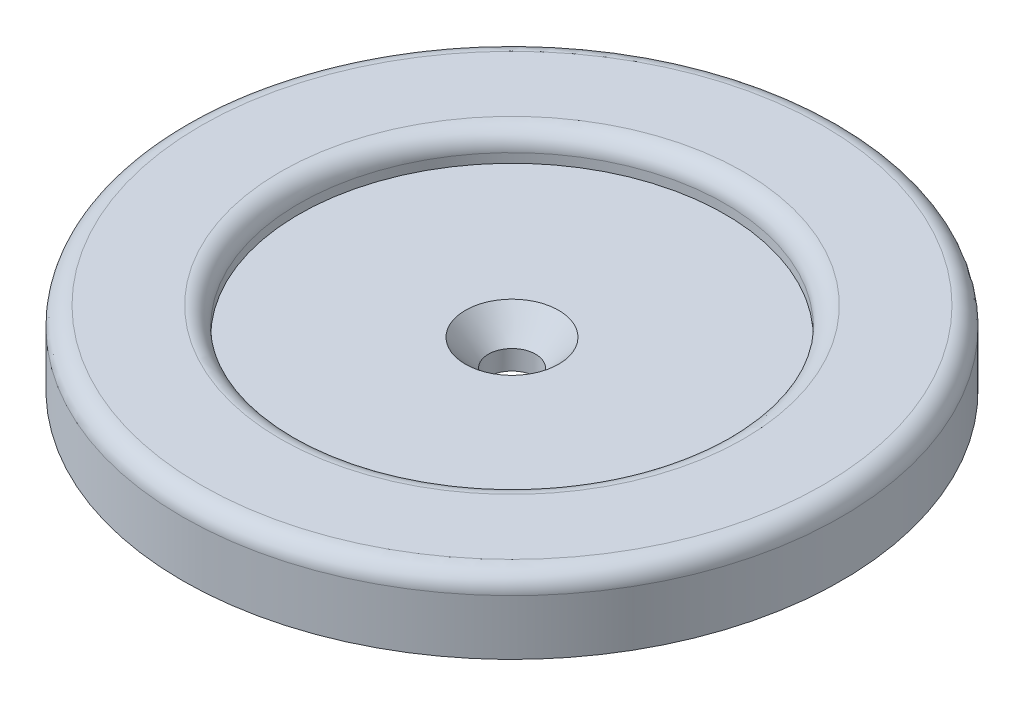
ISO-10303-21;
HEADER;
FILE_DESCRIPTION(('STEP AP214'),'2;1');
FILE_NAME('part.step','',(''),(''),'','','');
FILE_SCHEMA(('AUTOMOTIVE_DESIGN { 1 0 10303 214 1 1 1 1 }'));
ENDSEC;
DATA;
#1=APPLICATION_CONTEXT('core data for automotive mechanical design processes');
#2=APPLICATION_PROTOCOL_DEFINITION('international standard','automotive_design',2000,#1);
#3=PRODUCT_CONTEXT('',#1,'mechanical');
#4=PRODUCT('Part','Part','',(#3));
#5=PRODUCT_RELATED_PRODUCT_CATEGORY('part','',(#4));
#6=PRODUCT_DEFINITION_FORMATION('','',#4);
#7=PRODUCT_DEFINITION_CONTEXT('part definition',#1,'design');
#8=PRODUCT_DEFINITION('design','',#6,#7);
#9=PRODUCT_DEFINITION_SHAPE('','',#8);
#10=(LENGTH_UNIT() NAMED_UNIT(*) SI_UNIT(.MILLI.,.METRE.));
#11=(NAMED_UNIT(*) PLANE_ANGLE_UNIT() SI_UNIT($,.RADIAN.));
#12=(NAMED_UNIT(*) SI_UNIT($,.STERADIAN.) SOLID_ANGLE_UNIT());
#13=UNCERTAINTY_MEASURE_WITH_UNIT(LENGTH_MEASURE(1.E-05),#10,'distance_accuracy_value','');
#14=(GEOMETRIC_REPRESENTATION_CONTEXT(3) GLOBAL_UNCERTAINTY_ASSIGNED_CONTEXT((#13)) GLOBAL_UNIT_ASSIGNED_CONTEXT((#10,
#11,#12)) REPRESENTATION_CONTEXT('',''));
#15=CARTESIAN_POINT('',(0.,0.,0.));
#16=DIRECTION('',(0.,0.,1.));
#17=DIRECTION('',(1.,0.,0.));
#18=AXIS2_PLACEMENT_3D('',#15,#16,#17);
#19=CARTESIAN_POINT('',(0.,25.4,0.));
#20=DIRECTION('',(0.,1.,0.));
#21=DIRECTION('',(0.,0.,1.));
#22=AXIS2_PLACEMENT_3D('',#19,#20,#21);
#23=PLANE('',#22);
#24=CARTESIAN_POINT('',(0.,25.4,0.));
#25=DIRECTION('',(0.,1.,0.));
#26=DIRECTION('',(0.,0.,1.));
#27=AXIS2_PLACEMENT_3D('',#24,#25,#26);
#28=CIRCLE('',#27,6.4389);
#29=CARTESIAN_POINT('',(0.,25.4,6.4389));
#30=VERTEX_POINT('',#29);
#31=EDGE_CURVE('E75',#30,#30,#28,.T.);
#32=ORIENTED_EDGE('',*,*,#31,.F.);
#33=EDGE_LOOP('',(#32));
#34=FACE_BOUND('',#33,.T.);
#35=CARTESIAN_POINT('',(0.,25.4,0.));
#36=DIRECTION('',(0.,1.,0.));
#37=DIRECTION('',(0.,0.,1.));
#38=AXIS2_PLACEMENT_3D('',#35,#36,#37);
#39=CIRCLE('',#38,29.398178488335);
#40=CARTESIAN_POINT('',(0.,25.4,29.398178488335));
#41=VERTEX_POINT('',#40);
#42=EDGE_CURVE('E61',#41,#41,#39,.F.);
#43=ORIENTED_EDGE('',*,*,#42,.F.);
#44=EDGE_LOOP('',(#43));
#45=FACE_BOUND('',#44,.T.);
#46=ADVANCED_FACE('F37',(#34,#45),#23,.T.);
#47=CARTESIAN_POINT('',(0.,25.4,0.));
#48=DIRECTION('',(0.,-1.,0.));
#49=DIRECTION('',(0.,0.,-1.));
#50=AXIS2_PLACEMENT_3D('',#47,#48,#49);
#51=CYLINDRICAL_SURFACE('',#50,45.466);
#52=CARTESIAN_POINT('',(0.,26.67,0.));
#53=DIRECTION('',(0.,1.,0.));
#54=DIRECTION('',(0.,0.,1.));
#55=AXIS2_PLACEMENT_3D('',#52,#53,#54);
#56=CIRCLE('',#55,45.466);
#57=CARTESIAN_POINT('',(0.,26.67,45.466));
#58=VERTEX_POINT('',#57);
#59=EDGE_CURVE('E45',#58,#58,#56,.F.);
#60=ORIENTED_EDGE('',*,*,#59,.T.);
#61=EDGE_LOOP('',(#60));
#62=FACE_BOUND('',#61,.T.);
#63=CARTESIAN_POINT('',(0.,19.05,0.));
#64=DIRECTION('',(0.,-1.,0.));
#65=DIRECTION('',(0.,0.,-1.));
#66=AXIS2_PLACEMENT_3D('',#63,#64,#65);
#67=CIRCLE('',#66,45.466);
#68=CARTESIAN_POINT('',(0.,19.05,-45.466));
#69=VERTEX_POINT('',#68);
#70=EDGE_CURVE('E70',#69,#69,#67,.T.);
#71=ORIENTED_EDGE('',*,*,#70,.F.);
#72=EDGE_LOOP('',(#71));
#73=FACE_BOUND('',#72,.T.);
#74=ADVANCED_FACE('F308',(#62,#73),#51,.T.);
#75=CARTESIAN_POINT('',(0.,25.4,0.));
#76=DIRECTION('',(0.,1.,0.));
#77=DIRECTION('',(0.,0.,1.));
#78=AXIS2_PLACEMENT_3D('',#75,#76,#77);
#79=CYLINDRICAL_SURFACE('',#78,3.26389999999999);
#80=CARTESIAN_POINT('',(0.,21.7475803070733,0.));
#81=DIRECTION('',(0.,1.,0.));
#82=DIRECTION('',(0.,0.,1.));
#83=AXIS2_PLACEMENT_3D('',#80,#81,#82);
#84=CIRCLE('',#83,3.2639);
#85=CARTESIAN_POINT('',(0.,21.7475803070733,3.2639));
#86=VERTEX_POINT('',#85);
#87=EDGE_CURVE('E65',#86,#86,#84,.T.);
#88=ORIENTED_EDGE('',*,*,#87,.T.);
#89=EDGE_LOOP('',(#88));
#90=FACE_BOUND('',#89,.T.);
#91=CARTESIAN_POINT('',(0.,19.05,0.));
#92=DIRECTION('',(0.,-1.,0.));
#93=DIRECTION('',(0.,0.,-1.));
#94=AXIS2_PLACEMENT_3D('',#91,#92,#93);
#95=CIRCLE('',#94,3.26389999999999);
#96=CARTESIAN_POINT('',(0.,19.05,-3.26389999999999));
#97=VERTEX_POINT('',#96);
#98=EDGE_CURVE('E66',#97,#97,#95,.F.);
#99=ORIENTED_EDGE('',*,*,#98,.F.);
#100=EDGE_LOOP('',(#99));
#101=FACE_BOUND('',#100,.T.);
#102=ADVANCED_FACE('F310',(#90,#101),#79,.F.);
#103=CARTESIAN_POINT('',(0.,25.4,0.));
#104=DIRECTION('',(0.,1.,0.));
#105=DIRECTION('',(0.,0.,1.));
#106=AXIS2_PLACEMENT_3D('',#103,#104,#105);
#107=CONICAL_SURFACE('',#106,6.4389,0.715584993317675);
#108=ORIENTED_EDGE('',*,*,#87,.F.);
#109=EDGE_LOOP('',(#108));
#110=FACE_BOUND('',#109,.T.);
#111=ORIENTED_EDGE('',*,*,#31,.T.);
#112=EDGE_LOOP('',(#111));
#113=FACE_BOUND('',#112,.T.);
#114=ADVANCED_FACE('F287',(#110,#113),#107,.F.);
#115=CARTESIAN_POINT('',(0.,19.05,0.));
#116=DIRECTION('',(0.,-1.,0.));
#117=DIRECTION('',(0.,0.,-1.));
#118=AXIS2_PLACEMENT_3D('',#115,#116,#117);
#119=PLANE('',#118);
#120=CARTESIAN_POINT('',(-33.177315830712,19.05,-19.1549322258546));
#121=DIRECTION('',(0.,-1.,0.));
#122=DIRECTION('',(0.,0.,-1.));
#123=AXIS2_PLACEMENT_3D('',#120,#121,#122);
#124=CIRCLE('',#123,3.13086445170937);
#125=CARTESIAN_POINT('',(-33.177315830712,19.05,-22.2857966775639));
#126=VERTEX_POINT('',#125);
#127=EDGE_CURVE('E154',#126,#126,#124,.T.);
#128=ORIENTED_EDGE('',*,*,#127,.F.);
#129=EDGE_LOOP('',(#128));
#130=FACE_BOUND('',#129,.T.);
#131=CARTESIAN_POINT('',(-27.0891649401346,19.05,-27.0891649401399));
#132=DIRECTION('',(0.,-1.,0.));
#133=DIRECTION('',(0.,0.,-1.));
#134=AXIS2_PLACEMENT_3D('',#131,#132,#133);
#135=CIRCLE('',#134,3.13086445170968);
#136=CARTESIAN_POINT('',(-27.0891649401346,19.05,-30.2200293918495));
#137=VERTEX_POINT('',#136);
#138=EDGE_CURVE('E163',#137,#137,#135,.T.);
#139=ORIENTED_EDGE('',*,*,#138,.F.);
#140=EDGE_LOOP('',(#139));
#141=FACE_BOUND('',#140,.T.);
#142=CARTESIAN_POINT('',(-19.1549322258486,19.05,-33.1773158307163));
#143=DIRECTION('',(0.,-1.,0.));
#144=DIRECTION('',(0.,0.,-1.));
#145=AXIS2_PLACEMENT_3D('',#142,#143,#144);
#146=CIRCLE('',#145,3.13086445170985);
#147=CARTESIAN_POINT('',(-19.1549322258486,19.05,-36.3081802824262));
#148=VERTEX_POINT('',#147);
#149=EDGE_CURVE('E171',#148,#148,#146,.T.);
#150=ORIENTED_EDGE('',*,*,#149,.F.);
#151=EDGE_LOOP('',(#150));
#152=FACE_BOUND('',#151,.T.);
#153=CARTESIAN_POINT('',(-9.9153225353931,19.05,-37.0044874755363));
#154=DIRECTION('',(0.,-1.,0.));
#155=DIRECTION('',(0.,0.,-1.));
#156=AXIS2_PLACEMENT_3D('',#153,#154,#155);
#157=CIRCLE('',#156,3.13086445170988);
#158=CARTESIAN_POINT('',(-9.9153225353931,19.05,-40.1353519272461));
#159=VERTEX_POINT('',#158);
#160=EDGE_CURVE('E179',#159,#159,#157,.T.);
#161=ORIENTED_EDGE('',*,*,#160,.F.);
#162=EDGE_LOOP('',(#161));
#163=FACE_BOUND('',#162,.T.);
#164=CARTESIAN_POINT('',(4.34594413248282E-12,19.05,-38.3098644517054));
#165=DIRECTION('',(0.,-1.,0.));
#166=DIRECTION('',(0.,0.,-1.));
#167=AXIS2_PLACEMENT_3D('',#164,#165,#166);
#168=CIRCLE('',#167,3.13086445170976);
#169=CARTESIAN_POINT('',(4.34594413248282E-12,19.05,-41.4407289034151));
#170=VERTEX_POINT('',#169);
#171=EDGE_CURVE('E187',#170,#170,#168,.T.);
#172=ORIENTED_EDGE('',*,*,#171,.F.);
#173=EDGE_LOOP('',(#172));
#174=FACE_BOUND('',#173,.T.);
#175=CARTESIAN_POINT('',(9.91532253540166,19.05,-37.0044874755351));
#176=DIRECTION('',(0.,-1.,0.));
#177=DIRECTION('',(0.,0.,-1.));
#178=AXIS2_PLACEMENT_3D('',#175,#176,#177);
#179=CIRCLE('',#178,3.13086445170949);
#180=CARTESIAN_POINT('',(9.91532253540166,19.05,-40.1353519272446));
#181=VERTEX_POINT('',#180);
#182=EDGE_CURVE('E195',#181,#181,#179,.T.);
#183=ORIENTED_EDGE('',*,*,#182,.F.);
#184=EDGE_LOOP('',(#183));
#185=FACE_BOUND('',#184,.T.);
#186=CARTESIAN_POINT('',(19.1549322258567,19.05,-33.1773158307142));
#187=DIRECTION('',(0.,-1.,0.));
#188=DIRECTION('',(0.,0.,-1.));
#189=AXIS2_PLACEMENT_3D('',#186,#187,#188);
#190=CIRCLE('',#189,3.13086445170913);
#191=CARTESIAN_POINT('',(19.1549322258567,19.05,-36.3081802824233));
#192=VERTEX_POINT('',#191);
#193=EDGE_CURVE('E203',#192,#192,#190,.T.);
#194=ORIENTED_EDGE('',*,*,#193,.F.);
#195=EDGE_LOOP('',(#194));
#196=FACE_BOUND('',#195,.T.);
#197=CARTESIAN_POINT('',(27.089164940142,19.05,-27.0891649401368));
#198=DIRECTION('',(0.,-1.,0.));
#199=DIRECTION('',(0.,0.,-1.));
#200=AXIS2_PLACEMENT_3D('',#197,#198,#199);
#201=CIRCLE('',#200,3.13086445170864);
#202=CARTESIAN_POINT('',(27.089164940142,19.05,-30.2200293918454));
#203=VERTEX_POINT('',#202);
#204=EDGE_CURVE('E211',#203,#203,#201,.T.);
#205=ORIENTED_EDGE('',*,*,#204,.F.);
#206=EDGE_LOOP('',(#205));
#207=FACE_BOUND('',#206,.T.);
#208=CARTESIAN_POINT('',(33.1773158307185,19.05,-19.1549322258508));
#209=DIRECTION('',(0.,-1.,0.));
#210=DIRECTION('',(0.,0.,-1.));
#211=AXIS2_PLACEMENT_3D('',#208,#209,#210);
#212=CIRCLE('',#211,3.13086445170809);
#213=CARTESIAN_POINT('',(33.1773158307185,19.05,-22.2857966775589));
#214=VERTEX_POINT('',#213);
#215=EDGE_CURVE('E90',#214,#214,#212,.T.);
#216=ORIENTED_EDGE('',*,*,#215,.F.);
#217=EDGE_LOOP('',(#216));
#218=FACE_BOUND('',#217,.T.);
#219=CARTESIAN_POINT('',(37.0044874755384,19.05,-9.91532253539528));
#220=DIRECTION('',(0.,-1.,0.));
#221=DIRECTION('',(0.,0.,-1.));
#222=AXIS2_PLACEMENT_3D('',#219,#220,#221);
#223=CIRCLE('',#222,3.13086445170751);
#224=CARTESIAN_POINT('',(37.0044874755384,19.05,-13.0461869871028));
#225=VERTEX_POINT('',#224);
#226=EDGE_CURVE('E99',#225,#225,#223,.T.);
#227=ORIENTED_EDGE('',*,*,#226,.F.);
#228=EDGE_LOOP('',(#227));
#229=FACE_BOUND('',#228,.T.);
#230=CARTESIAN_POINT('',(38.3098644517075,19.05,2.17297206624141E-12));
#231=DIRECTION('',(0.,-1.,0.));
#232=DIRECTION('',(0.,0.,-1.));
#233=AXIS2_PLACEMENT_3D('',#230,#231,#232);
#234=CIRCLE('',#233,3.13086445170692);
#235=CARTESIAN_POINT('',(38.3098644517075,19.05,-3.13086445170475));
#236=VERTEX_POINT('',#235);
#237=EDGE_CURVE('E107',#236,#236,#234,.T.);
#238=ORIENTED_EDGE('',*,*,#237,.F.);
#239=EDGE_LOOP('',(#238));
#240=FACE_BOUND('',#239,.T.);
#241=CARTESIAN_POINT('',(37.0044874755373,19.05,9.91532253539949));
#242=DIRECTION('',(0.,-1.,0.));
#243=DIRECTION('',(0.,0.,-1.));
#244=AXIS2_PLACEMENT_3D('',#241,#242,#243);
#245=CIRCLE('',#244,3.13086445170639);
#246=CARTESIAN_POINT('',(37.0044874755373,19.05,6.7844580836931));
#247=VERTEX_POINT('',#246);
#248=EDGE_CURVE('E115',#247,#247,#245,.T.);
#249=ORIENTED_EDGE('',*,*,#248,.F.);
#250=EDGE_LOOP('',(#249));
#251=FACE_BOUND('',#250,.T.);
#252=CARTESIAN_POINT('',(33.1773158307163,19.05,19.1549322258546));
#253=DIRECTION('',(0.,-1.,0.));
#254=DIRECTION('',(0.,0.,-1.));
#255=AXIS2_PLACEMENT_3D('',#252,#253,#254);
#256=CIRCLE('',#255,3.13086445170593);
#257=CARTESIAN_POINT('',(33.1773158307163,19.05,16.0240677741486));
#258=VERTEX_POINT('',#257);
#259=EDGE_CURVE('E123',#258,#258,#256,.T.);
#260=ORIENTED_EDGE('',*,*,#259,.F.);
#261=EDGE_LOOP('',(#260));
#262=FACE_BOUND('',#261,.T.);
#263=CARTESIAN_POINT('',(27.0891649401389,19.05,27.0891649401398));
#264=DIRECTION('',(0.,-1.,0.));
#265=DIRECTION('',(0.,0.,-1.));
#266=AXIS2_PLACEMENT_3D('',#263,#264,#265);
#267=CIRCLE('',#266,3.13086445170557);
#268=CARTESIAN_POINT('',(27.0891649401389,19.05,23.9583004884343));
#269=VERTEX_POINT('',#268);
#270=EDGE_CURVE('E131',#269,#269,#267,.T.);
#271=ORIENTED_EDGE('',*,*,#270,.F.);
#272=EDGE_LOOP('',(#271));
#273=FACE_BOUND('',#272,.T.);
#274=CARTESIAN_POINT('',(19.154932225853,19.05,33.1773158307163));
#275=DIRECTION('',(0.,-1.,0.));
#276=DIRECTION('',(0.,0.,-1.));
#277=AXIS2_PLACEMENT_3D('',#274,#275,#276);
#278=CIRCLE('',#277,3.13086445170535);
#279=CARTESIAN_POINT('',(19.154932225853,19.05,30.046451379011));
#280=VERTEX_POINT('',#279);
#281=EDGE_CURVE('E139',#280,#280,#278,.T.);
#282=ORIENTED_EDGE('',*,*,#281,.F.);
#283=EDGE_LOOP('',(#282));
#284=FACE_BOUND('',#283,.T.);
#285=CARTESIAN_POINT('',(9.91532253539741,19.05,37.0044874755357));
#286=DIRECTION('',(0.,-1.,0.));
#287=DIRECTION('',(0.,0.,-1.));
#288=AXIS2_PLACEMENT_3D('',#285,#286,#287);
#289=CIRCLE('',#288,3.13086445170535);
#290=CARTESIAN_POINT('',(9.91532253539741,19.05,33.8736230238303));
#291=VERTEX_POINT('',#290);
#292=EDGE_CURVE('E147',#291,#291,#289,.T.);
#293=ORIENTED_EDGE('',*,*,#292,.F.);
#294=EDGE_LOOP('',(#293));
#295=FACE_BOUND('',#294,.T.);
#296=CARTESIAN_POINT('',(-37.004487475533,19.05,-9.91532253539951));
#297=DIRECTION('',(0.,-1.,0.));
#298=DIRECTION('',(0.,0.,-1.));
#299=AXIS2_PLACEMENT_3D('',#296,#297,#298);
#300=CIRCLE('',#299,3.13086445170897);
#301=CARTESIAN_POINT('',(-37.004487475533,19.05,-13.0461869871085));
#302=VERTEX_POINT('',#301);
#303=EDGE_CURVE('E266',#302,#302,#300,.T.);
#304=ORIENTED_EDGE('',*,*,#303,.F.);
#305=EDGE_LOOP('',(#304));
#306=FACE_BOUND('',#305,.T.);
#307=CARTESIAN_POINT('',(-38.3098644517032,19.05,-2.17766367152907E-12));
#308=DIRECTION('',(0.,-1.,0.));
#309=DIRECTION('',(0.,0.,-1.));
#310=AXIS2_PLACEMENT_3D('',#307,#308,#309);
#311=CIRCLE('',#310,3.13086445170845);
#312=CARTESIAN_POINT('',(-38.3098644517032,19.05,-3.13086445171063));
#313=VERTEX_POINT('',#312);
#314=EDGE_CURVE('E258',#313,#313,#311,.T.);
#315=ORIENTED_EDGE('',*,*,#314,.F.);
#316=EDGE_LOOP('',(#315));
#317=FACE_BOUND('',#316,.T.);
#318=CARTESIAN_POINT('',(-37.0044874755341,19.05,9.91532253539527));
#319=DIRECTION('',(0.,-1.,0.));
#320=DIRECTION('',(0.,0.,-1.));
#321=AXIS2_PLACEMENT_3D('',#318,#319,#320);
#322=CIRCLE('',#321,3.13086445170793);
#323=CARTESIAN_POINT('',(-37.0044874755341,19.05,6.78445808368734));
#324=VERTEX_POINT('',#323);
#325=EDGE_CURVE('E250',#324,#324,#322,.T.);
#326=ORIENTED_EDGE('',*,*,#325,.F.);
#327=EDGE_LOOP('',(#326));
#328=FACE_BOUND('',#327,.T.);
#329=CARTESIAN_POINT('',(-33.1773158307142,19.05,19.1549322258508));
#330=DIRECTION('',(0.,-1.,0.));
#331=DIRECTION('',(0.,0.,-1.));
#332=AXIS2_PLACEMENT_3D('',#329,#330,#331);
#333=CIRCLE('',#332,3.13086445170739);
#334=CARTESIAN_POINT('',(-33.1773158307142,19.05,16.0240677741434));
#335=VERTEX_POINT('',#334);
#336=EDGE_CURVE('E242',#335,#335,#333,.T.);
#337=ORIENTED_EDGE('',*,*,#336,.F.);
#338=EDGE_LOOP('',(#337));
#339=FACE_BOUND('',#338,.T.);
#340=CARTESIAN_POINT('',(-27.0891649401377,19.05,27.0891649401368));
#341=DIRECTION('',(0.,-1.,0.));
#342=DIRECTION('',(0.,0.,-1.));
#343=AXIS2_PLACEMENT_3D('',#340,#341,#342);
#344=CIRCLE('',#343,3.13086445170686);
#345=CARTESIAN_POINT('',(-27.0891649401377,19.05,23.9583004884299));
#346=VERTEX_POINT('',#345);
#347=EDGE_CURVE('E234',#346,#346,#344,.T.);
#348=ORIENTED_EDGE('',*,*,#347,.F.);
#349=EDGE_LOOP('',(#348));
#350=FACE_BOUND('',#349,.T.);
#351=CARTESIAN_POINT('',(-19.1549322258524,19.05,33.1773158307142));
#352=DIRECTION('',(0.,-1.,0.));
#353=DIRECTION('',(0.,0.,-1.));
#354=AXIS2_PLACEMENT_3D('',#351,#352,#353);
#355=CIRCLE('',#354,3.13086445170644);
#356=CARTESIAN_POINT('',(-19.1549322258524,19.05,30.0464513790077));
#357=VERTEX_POINT('',#356);
#358=EDGE_CURVE('E226',#357,#357,#355,.T.);
#359=ORIENTED_EDGE('',*,*,#358,.F.);
#360=EDGE_LOOP('',(#359));
#361=FACE_BOUND('',#360,.T.);
#362=CARTESIAN_POINT('',(-9.91532253539689,19.05,37.0044874755358));
#363=DIRECTION('',(0.,-1.,0.));
#364=DIRECTION('',(0.,0.,-1.));
#365=AXIS2_PLACEMENT_3D('',#362,#363,#364);
#366=CIRCLE('',#365,3.13086445170535);
#367=CARTESIAN_POINT('',(-9.91532253539689,19.05,33.8736230238305));
#368=VERTEX_POINT('',#367);
#369=EDGE_CURVE('E218',#368,#368,#366,.T.);
#370=ORIENTED_EDGE('',*,*,#369,.F.);
#371=EDGE_LOOP('',(#370));
#372=FACE_BOUND('',#371,.T.);
#373=CARTESIAN_POINT('',(0.,19.05,38.3098644517054));
#374=DIRECTION('',(0.,-1.,0.));
#375=DIRECTION('',(0.,0.,-1.));
#376=AXIS2_PLACEMENT_3D('',#373,#374,#375);
#377=CIRCLE('',#376,3.13086445170535);
#378=CARTESIAN_POINT('',(0.,19.05,35.179));
#379=VERTEX_POINT('',#378);
#380=EDGE_CURVE('E82',#379,#379,#377,.T.);
#381=ORIENTED_EDGE('',*,*,#380,.F.);
#382=EDGE_LOOP('',(#381));
#383=FACE_BOUND('',#382,.T.);
#384=ORIENTED_EDGE('',*,*,#98,.T.);
#385=EDGE_LOOP('',(#384));
#386=FACE_BOUND('',#385,.T.);
#387=ORIENTED_EDGE('',*,*,#70,.T.);
#388=EDGE_LOOP('',(#387));
#389=FACE_BOUND('',#388,.T.);
#390=ADVANCED_FACE('F283',(#130,#141,#152,#163,#174,#185,#196,#207,#218,#229,#240,#251,#262,
#273,#284,#295,#306,#317,#328,#339,#350,#361,#372,#383,#386,#389),#119,.T.);
#391=CARTESIAN_POINT('',(0.,29.21,0.));
#392=DIRECTION('',(0.,1.,0.));
#393=DIRECTION('',(0.,0.,1.));
#394=AXIS2_PLACEMENT_3D('',#391,#392,#393);
#395=PLANE('',#394);
#396=CARTESIAN_POINT('',(0.,29.21,0.));
#397=DIRECTION('',(0.,1.,0.));
#398=DIRECTION('',(0.,0.,1.));
#399=AXIS2_PLACEMENT_3D('',#396,#397,#398);
#400=CIRCLE('',#399,42.926);
#401=CARTESIAN_POINT('',(0.,29.21,42.926));
#402=VERTEX_POINT('',#401);
#403=EDGE_CURVE('E50',#402,#402,#400,.T.);
#404=ORIENTED_EDGE('',*,*,#403,.T.);
#405=EDGE_LOOP('',(#404));
#406=FACE_BOUND('',#405,.T.);
#407=CARTESIAN_POINT('',(0.,29.21,0.));
#408=DIRECTION('',(0.,1.,0.));
#409=DIRECTION('',(0.,0.,1.));
#410=AXIS2_PLACEMENT_3D('',#407,#408,#409);
#411=CIRCLE('',#410,31.938178488335);
#412=CARTESIAN_POINT('',(0.,29.21,31.938178488335));
#413=VERTEX_POINT('',#412);
#414=EDGE_CURVE('E55',#413,#413,#411,.F.);
#415=ORIENTED_EDGE('',*,*,#414,.T.);
#416=EDGE_LOOP('',(#415));
#417=FACE_BOUND('',#416,.T.);
#418=ADVANCED_FACE('F286',(#406,#417),#395,.T.);
#419=CARTESIAN_POINT('',(0.,29.21,0.));
#420=DIRECTION('',(0.,-1.,0.));
#421=DIRECTION('',(0.,0.,-1.));
#422=AXIS2_PLACEMENT_3D('',#419,#420,#421);
#423=CYLINDRICAL_SURFACE('',#422,29.398178488335);
#424=CARTESIAN_POINT('',(0.,26.67,0.));
#425=DIRECTION('',(0.,1.,0.));
#426=DIRECTION('',(0.,0.,1.));
#427=AXIS2_PLACEMENT_3D('',#424,#425,#426);
#428=CIRCLE('',#427,29.398178488335);
#429=CARTESIAN_POINT('',(0.,26.67,29.398178488335));
#430=VERTEX_POINT('',#429);
#431=EDGE_CURVE('E10',#430,#430,#428,.T.);
#432=ORIENTED_EDGE('',*,*,#431,.T.);
#433=EDGE_LOOP('',(#432));
#434=FACE_BOUND('',#433,.T.);
#435=ORIENTED_EDGE('',*,*,#42,.T.);
#436=EDGE_LOOP('',(#435));
#437=FACE_BOUND('',#436,.T.);
#438=ADVANCED_FACE('F338',(#434,#437),#423,.F.);
#439=CARTESIAN_POINT('',(0.,25.4,38.3098644517054));
#440=DIRECTION('',(0.,-1.,0.));
#441=DIRECTION('',(0.,0.,-1.));
#442=AXIS2_PLACEMENT_3D('',#439,#440,#441);
#443=CYLINDRICAL_SURFACE('',#442,3.13086445170535);
#444=CARTESIAN_POINT('',(0.,25.4,38.3098644517054));
#445=DIRECTION('',(0.,-1.,0.));
#446=DIRECTION('',(0.,0.,-1.));
#447=AXIS2_PLACEMENT_3D('',#444,#445,#446);
#448=CIRCLE('',#447,3.13086445170535);
#449=CARTESIAN_POINT('',(0.,25.4,35.179));
#450=VERTEX_POINT('',#449);
#451=EDGE_CURVE('E71',#450,#450,#448,.T.);
#452=ORIENTED_EDGE('',*,*,#451,.F.);
#453=EDGE_LOOP('',(#452));
#454=FACE_BOUND('',#453,.T.);
#455=ORIENTED_EDGE('',*,*,#380,.T.);
#456=EDGE_LOOP('',(#455));
#457=FACE_BOUND('',#456,.T.);
#458=ADVANCED_FACE('F345',(#454,#457),#443,.F.);
#459=CARTESIAN_POINT('',(0.,25.4,38.3098644517054));
#460=DIRECTION('',(0.,-1.,0.));
#461=DIRECTION('',(0.,0.,-1.));
#462=AXIS2_PLACEMENT_3D('',#459,#460,#461);
#463=PLANE('',#462);
#464=ORIENTED_EDGE('',*,*,#451,.T.);
#465=EDGE_LOOP('',(#464));
#466=FACE_BOUND('',#465,.T.);
#467=ADVANCED_FACE('F399',(#466),#463,.T.);
#468=CARTESIAN_POINT('',(-9.91532253539689,25.4,37.0044874755358));
#469=DIRECTION('',(0.,-1.,0.));
#470=DIRECTION('',(0.,0.,-1.));
#471=AXIS2_PLACEMENT_3D('',#468,#469,#470);
#472=CYLINDRICAL_SURFACE('',#471,3.13086445170535);
#473=CARTESIAN_POINT('',(-9.91532253539689,25.4,37.0044874755358));
#474=DIRECTION('',(0.,-1.,0.));
#475=DIRECTION('',(0.,0.,-1.));
#476=AXIS2_PLACEMENT_3D('',#473,#474,#475);
#477=CIRCLE('',#476,3.13086445170535);
#478=CARTESIAN_POINT('',(-9.91532253539689,25.4,33.8736230238305));
#479=VERTEX_POINT('',#478);
#480=EDGE_CURVE('E222',#479,#479,#477,.T.);
#481=ORIENTED_EDGE('',*,*,#480,.F.);
#482=EDGE_LOOP('',(#481));
#483=FACE_BOUND('',#482,.T.);
#484=ORIENTED_EDGE('',*,*,#369,.T.);
#485=EDGE_LOOP('',(#484));
#486=FACE_BOUND('',#485,.T.);
#487=ADVANCED_FACE('F407',(#483,#486),#472,.F.);
#488=CARTESIAN_POINT('',(-9.91532253539689,25.4,37.0044874755358));
#489=DIRECTION('',(0.,-1.,0.));
#490=DIRECTION('',(0.,0.,-1.));
#491=AXIS2_PLACEMENT_3D('',#488,#489,#490);
#492=PLANE('',#491);
#493=ORIENTED_EDGE('',*,*,#480,.T.);
#494=EDGE_LOOP('',(#493));
#495=FACE_BOUND('',#494,.T.);
#496=ADVANCED_FACE('F416',(#495),#492,.T.);
#497=CARTESIAN_POINT('',(-19.1549322258524,25.4,33.1773158307142));
#498=DIRECTION('',(0.,-1.,0.));
#499=DIRECTION('',(0.,0.,-1.));
#500=AXIS2_PLACEMENT_3D('',#497,#498,#499);
#501=CYLINDRICAL_SURFACE('',#500,3.13086445170644);
#502=CARTESIAN_POINT('',(-19.1549322258524,25.4,33.1773158307142));
#503=DIRECTION('',(0.,-1.,0.));
#504=DIRECTION('',(0.,0.,-1.));
#505=AXIS2_PLACEMENT_3D('',#502,#503,#504);
#506=CIRCLE('',#505,3.13086445170644);
#507=CARTESIAN_POINT('',(-19.1549322258524,25.4,30.0464513790077));
#508=VERTEX_POINT('',#507);
#509=EDGE_CURVE('E230',#508,#508,#506,.T.);
#510=ORIENTED_EDGE('',*,*,#509,.F.);
#511=EDGE_LOOP('',(#510));
#512=FACE_BOUND('',#511,.T.);
#513=ORIENTED_EDGE('',*,*,#358,.T.);
#514=EDGE_LOOP('',(#513));
#515=FACE_BOUND('',#514,.T.);
#516=ADVANCED_FACE('F425',(#512,#515),#501,.F.);
#517=CARTESIAN_POINT('',(-19.1549322258524,25.4,33.1773158307142));
#518=DIRECTION('',(0.,-1.,0.));
#519=DIRECTION('',(0.,0.,-1.));
#520=AXIS2_PLACEMENT_3D('',#517,#518,#519);
#521=PLANE('',#520);
#522=ORIENTED_EDGE('',*,*,#509,.T.);
#523=EDGE_LOOP('',(#522));
#524=FACE_BOUND('',#523,.T.);
#525=ADVANCED_FACE('F434',(#524),#521,.T.);
#526=CARTESIAN_POINT('',(-27.0891649401377,25.4,27.0891649401368));
#527=DIRECTION('',(0.,-1.,0.));
#528=DIRECTION('',(0.,0.,-1.));
#529=AXIS2_PLACEMENT_3D('',#526,#527,#528);
#530=CYLINDRICAL_SURFACE('',#529,3.13086445170686);
#531=CARTESIAN_POINT('',(-27.0891649401377,25.4,27.0891649401368));
#532=DIRECTION('',(0.,-1.,0.));
#533=DIRECTION('',(0.,0.,-1.));
#534=AXIS2_PLACEMENT_3D('',#531,#532,#533);
#535=CIRCLE('',#534,3.13086445170686);
#536=CARTESIAN_POINT('',(-27.0891649401377,25.4,23.9583004884299));
#537=VERTEX_POINT('',#536);
#538=EDGE_CURVE('E238',#537,#537,#535,.T.);
#539=ORIENTED_EDGE('',*,*,#538,.F.);
#540=EDGE_LOOP('',(#539));
#541=FACE_BOUND('',#540,.T.);
#542=ORIENTED_EDGE('',*,*,#347,.T.);
#543=EDGE_LOOP('',(#542));
#544=FACE_BOUND('',#543,.T.);
#545=ADVANCED_FACE('F443',(#541,#544),#530,.F.);
#546=CARTESIAN_POINT('',(-27.0891649401377,25.4,27.0891649401368));
#547=DIRECTION('',(0.,-1.,0.));
#548=DIRECTION('',(0.,0.,-1.));
#549=AXIS2_PLACEMENT_3D('',#546,#547,#548);
#550=PLANE('',#549);
#551=ORIENTED_EDGE('',*,*,#538,.T.);
#552=EDGE_LOOP('',(#551));
#553=FACE_BOUND('',#552,.T.);
#554=ADVANCED_FACE('F452',(#553),#550,.T.);
#555=CARTESIAN_POINT('',(-33.1773158307142,25.4,19.1549322258508));
#556=DIRECTION('',(0.,-1.,0.));
#557=DIRECTION('',(0.,0.,-1.));
#558=AXIS2_PLACEMENT_3D('',#555,#556,#557);
#559=CYLINDRICAL_SURFACE('',#558,3.13086445170739);
#560=CARTESIAN_POINT('',(-33.1773158307142,25.4,19.1549322258508));
#561=DIRECTION('',(0.,-1.,0.));
#562=DIRECTION('',(0.,0.,-1.));
#563=AXIS2_PLACEMENT_3D('',#560,#561,#562);
#564=CIRCLE('',#563,3.13086445170739);
#565=CARTESIAN_POINT('',(-33.1773158307142,25.4,16.0240677741434));
#566=VERTEX_POINT('',#565);
#567=EDGE_CURVE('E246',#566,#566,#564,.T.);
#568=ORIENTED_EDGE('',*,*,#567,.F.);
#569=EDGE_LOOP('',(#568));
#570=FACE_BOUND('',#569,.T.);
#571=ORIENTED_EDGE('',*,*,#336,.T.);
#572=EDGE_LOOP('',(#571));
#573=FACE_BOUND('',#572,.T.);
#574=ADVANCED_FACE('F461',(#570,#573),#559,.F.);
#575=CARTESIAN_POINT('',(-33.1773158307142,25.4,19.1549322258508));
#576=DIRECTION('',(0.,-1.,0.));
#577=DIRECTION('',(0.,0.,-1.));
#578=AXIS2_PLACEMENT_3D('',#575,#576,#577);
#579=PLANE('',#578);
#580=ORIENTED_EDGE('',*,*,#567,.T.);
#581=EDGE_LOOP('',(#580));
#582=FACE_BOUND('',#581,.T.);
#583=ADVANCED_FACE('F470',(#582),#579,.T.);
#584=CARTESIAN_POINT('',(-37.0044874755341,25.4,9.91532253539527));
#585=DIRECTION('',(0.,-1.,0.));
#586=DIRECTION('',(0.,0.,-1.));
#587=AXIS2_PLACEMENT_3D('',#584,#585,#586);
#588=CYLINDRICAL_SURFACE('',#587,3.13086445170793);
#589=CARTESIAN_POINT('',(-37.0044874755341,25.4,9.91532253539527));
#590=DIRECTION('',(0.,-1.,0.));
#591=DIRECTION('',(0.,0.,-1.));
#592=AXIS2_PLACEMENT_3D('',#589,#590,#591);
#593=CIRCLE('',#592,3.13086445170793);
#594=CARTESIAN_POINT('',(-37.0044874755341,25.4,6.78445808368734));
#595=VERTEX_POINT('',#594);
#596=EDGE_CURVE('E254',#595,#595,#593,.T.);
#597=ORIENTED_EDGE('',*,*,#596,.F.);
#598=EDGE_LOOP('',(#597));
#599=FACE_BOUND('',#598,.T.);
#600=ORIENTED_EDGE('',*,*,#325,.T.);
#601=EDGE_LOOP('',(#600));
#602=FACE_BOUND('',#601,.T.);
#603=ADVANCED_FACE('F479',(#599,#602),#588,.F.);
#604=CARTESIAN_POINT('',(-37.0044874755341,25.4,9.91532253539527));
#605=DIRECTION('',(0.,-1.,0.));
#606=DIRECTION('',(0.,0.,-1.));
#607=AXIS2_PLACEMENT_3D('',#604,#605,#606);
#608=PLANE('',#607);
#609=ORIENTED_EDGE('',*,*,#596,.T.);
#610=EDGE_LOOP('',(#609));
#611=FACE_BOUND('',#610,.T.);
#612=ADVANCED_FACE('F488',(#611),#608,.T.);
#613=CARTESIAN_POINT('',(-38.3098644517032,25.4,-2.17766367152907E-12));
#614=DIRECTION('',(0.,-1.,0.));
#615=DIRECTION('',(0.,0.,-1.));
#616=AXIS2_PLACEMENT_3D('',#613,#614,#615);
#617=CYLINDRICAL_SURFACE('',#616,3.13086445170845);
#618=CARTESIAN_POINT('',(-38.3098644517032,25.4,-2.17766367152907E-12));
#619=DIRECTION('',(0.,-1.,0.));
#620=DIRECTION('',(0.,0.,-1.));
#621=AXIS2_PLACEMENT_3D('',#618,#619,#620);
#622=CIRCLE('',#621,3.13086445170845);
#623=CARTESIAN_POINT('',(-38.3098644517032,25.4,-3.13086445171063));
#624=VERTEX_POINT('',#623);
#625=EDGE_CURVE('E262',#624,#624,#622,.T.);
#626=ORIENTED_EDGE('',*,*,#625,.F.);
#627=EDGE_LOOP('',(#626));
#628=FACE_BOUND('',#627,.T.);
#629=ORIENTED_EDGE('',*,*,#314,.T.);
#630=EDGE_LOOP('',(#629));
#631=FACE_BOUND('',#630,.T.);
#632=ADVANCED_FACE('F497',(#628,#631),#617,.F.);
#633=CARTESIAN_POINT('',(-38.3098644517032,25.4,-2.17766367152907E-12));
#634=DIRECTION('',(0.,-1.,0.));
#635=DIRECTION('',(0.,0.,-1.));
#636=AXIS2_PLACEMENT_3D('',#633,#634,#635);
#637=PLANE('',#636);
#638=ORIENTED_EDGE('',*,*,#625,.T.);
#639=EDGE_LOOP('',(#638));
#640=FACE_BOUND('',#639,.T.);
#641=ADVANCED_FACE('F279',(#640),#637,.T.);
#642=CARTESIAN_POINT('',(-37.004487475533,25.4,-9.91532253539951));
#643=DIRECTION('',(0.,-1.,0.));
#644=DIRECTION('',(0.,0.,-1.));
#645=AXIS2_PLACEMENT_3D('',#642,#643,#644);
#646=CYLINDRICAL_SURFACE('',#645,3.13086445170897);
#647=CARTESIAN_POINT('',(-37.004487475533,25.4,-9.91532253539951));
#648=DIRECTION('',(0.,-1.,0.));
#649=DIRECTION('',(0.,0.,-1.));
#650=AXIS2_PLACEMENT_3D('',#647,#648,#649);
#651=CIRCLE('',#650,3.13086445170897);
#652=CARTESIAN_POINT('',(-37.004487475533,25.4,-13.0461869871085));
#653=VERTEX_POINT('',#652);
#654=EDGE_CURVE('E159',#653,#653,#651,.T.);
#655=ORIENTED_EDGE('',*,*,#654,.F.);
#656=EDGE_LOOP('',(#655));
#657=FACE_BOUND('',#656,.T.);
#658=ORIENTED_EDGE('',*,*,#303,.T.);
#659=EDGE_LOOP('',(#658));
#660=FACE_BOUND('',#659,.T.);
#661=ADVANCED_FACE('F276',(#657,#660),#646,.F.);
#662=CARTESIAN_POINT('',(-37.004487475533,25.4,-9.91532253539951));
#663=DIRECTION('',(0.,-1.,0.));
#664=DIRECTION('',(0.,0.,-1.));
#665=AXIS2_PLACEMENT_3D('',#662,#663,#664);
#666=PLANE('',#665);
#667=ORIENTED_EDGE('',*,*,#654,.T.);
#668=EDGE_LOOP('',(#667));
#669=FACE_BOUND('',#668,.T.);
#670=ADVANCED_FACE('F274',(#669),#666,.T.);
#671=CARTESIAN_POINT('',(9.91532253539741,25.4,37.0044874755357));
#672=DIRECTION('',(0.,-1.,0.));
#673=DIRECTION('',(0.,0.,-1.));
#674=AXIS2_PLACEMENT_3D('',#671,#672,#673);
#675=CYLINDRICAL_SURFACE('',#674,3.13086445170535);
#676=CARTESIAN_POINT('',(9.91532253539741,25.4,37.0044874755357));
#677=DIRECTION('',(0.,-1.,0.));
#678=DIRECTION('',(0.,0.,-1.));
#679=AXIS2_PLACEMENT_3D('',#676,#677,#678);
#680=CIRCLE('',#679,3.13086445170535);
#681=CARTESIAN_POINT('',(9.91532253539741,25.4,33.8736230238303));
#682=VERTEX_POINT('',#681);
#683=EDGE_CURVE('E86',#682,#682,#680,.T.);
#684=ORIENTED_EDGE('',*,*,#683,.F.);
#685=EDGE_LOOP('',(#684));
#686=FACE_BOUND('',#685,.T.);
#687=ORIENTED_EDGE('',*,*,#292,.T.);
#688=EDGE_LOOP('',(#687));
#689=FACE_BOUND('',#688,.T.);
#690=ADVANCED_FACE('F527',(#686,#689),#675,.F.);
#691=CARTESIAN_POINT('',(9.91532253539741,25.4,37.0044874755357));
#692=DIRECTION('',(0.,-1.,0.));
#693=DIRECTION('',(0.,0.,-1.));
#694=AXIS2_PLACEMENT_3D('',#691,#692,#693);
#695=PLANE('',#694);
#696=ORIENTED_EDGE('',*,*,#683,.T.);
#697=EDGE_LOOP('',(#696));
#698=FACE_BOUND('',#697,.T.);
#699=ADVANCED_FACE('F535',(#698),#695,.T.);
#700=CARTESIAN_POINT('',(19.154932225853,25.4,33.1773158307163));
#701=DIRECTION('',(0.,-1.,0.));
#702=DIRECTION('',(0.,0.,-1.));
#703=AXIS2_PLACEMENT_3D('',#700,#701,#702);
#704=CYLINDRICAL_SURFACE('',#703,3.13086445170535);
#705=CARTESIAN_POINT('',(19.154932225853,25.4,33.1773158307163));
#706=DIRECTION('',(0.,-1.,0.));
#707=DIRECTION('',(0.,0.,-1.));
#708=AXIS2_PLACEMENT_3D('',#705,#706,#707);
#709=CIRCLE('',#708,3.13086445170535);
#710=CARTESIAN_POINT('',(19.154932225853,25.4,30.046451379011));
#711=VERTEX_POINT('',#710);
#712=EDGE_CURVE('E143',#711,#711,#709,.T.);
#713=ORIENTED_EDGE('',*,*,#712,.F.);
#714=EDGE_LOOP('',(#713));
#715=FACE_BOUND('',#714,.T.);
#716=ORIENTED_EDGE('',*,*,#281,.T.);
#717=EDGE_LOOP('',(#716));
#718=FACE_BOUND('',#717,.T.);
#719=ADVANCED_FACE('F544',(#715,#718),#704,.F.);
#720=CARTESIAN_POINT('',(19.154932225853,25.4,33.1773158307163));
#721=DIRECTION('',(0.,-1.,0.));
#722=DIRECTION('',(0.,0.,-1.));
#723=AXIS2_PLACEMENT_3D('',#720,#721,#722);
#724=PLANE('',#723);
#725=ORIENTED_EDGE('',*,*,#712,.T.);
#726=EDGE_LOOP('',(#725));
#727=FACE_BOUND('',#726,.T.);
#728=ADVANCED_FACE('F553',(#727),#724,.T.);
#729=CARTESIAN_POINT('',(27.0891649401389,25.4,27.0891649401398));
#730=DIRECTION('',(0.,-1.,0.));
#731=DIRECTION('',(0.,0.,-1.));
#732=AXIS2_PLACEMENT_3D('',#729,#730,#731);
#733=CYLINDRICAL_SURFACE('',#732,3.13086445170557);
#734=CARTESIAN_POINT('',(27.0891649401389,25.4,27.0891649401398));
#735=DIRECTION('',(0.,-1.,0.));
#736=DIRECTION('',(0.,0.,-1.));
#737=AXIS2_PLACEMENT_3D('',#734,#735,#736);
#738=CIRCLE('',#737,3.13086445170557);
#739=CARTESIAN_POINT('',(27.0891649401389,25.4,23.9583004884343));
#740=VERTEX_POINT('',#739);
#741=EDGE_CURVE('E135',#740,#740,#738,.T.);
#742=ORIENTED_EDGE('',*,*,#741,.F.);
#743=EDGE_LOOP('',(#742));
#744=FACE_BOUND('',#743,.T.);
#745=ORIENTED_EDGE('',*,*,#270,.T.);
#746=EDGE_LOOP('',(#745));
#747=FACE_BOUND('',#746,.T.);
#748=ADVANCED_FACE('F562',(#744,#747),#733,.F.);
#749=CARTESIAN_POINT('',(27.0891649401389,25.4,27.0891649401398));
#750=DIRECTION('',(0.,-1.,0.));
#751=DIRECTION('',(0.,0.,-1.));
#752=AXIS2_PLACEMENT_3D('',#749,#750,#751);
#753=PLANE('',#752);
#754=ORIENTED_EDGE('',*,*,#741,.T.);
#755=EDGE_LOOP('',(#754));
#756=FACE_BOUND('',#755,.T.);
#757=ADVANCED_FACE('F571',(#756),#753,.T.);
#758=CARTESIAN_POINT('',(33.1773158307163,25.4,19.1549322258546));
#759=DIRECTION('',(0.,-1.,0.));
#760=DIRECTION('',(0.,0.,-1.));
#761=AXIS2_PLACEMENT_3D('',#758,#759,#760);
#762=CYLINDRICAL_SURFACE('',#761,3.13086445170593);
#763=CARTESIAN_POINT('',(33.1773158307163,25.4,19.1549322258546));
#764=DIRECTION('',(0.,-1.,0.));
#765=DIRECTION('',(0.,0.,-1.));
#766=AXIS2_PLACEMENT_3D('',#763,#764,#765);
#767=CIRCLE('',#766,3.13086445170593);
#768=CARTESIAN_POINT('',(33.1773158307163,25.4,16.0240677741486));
#769=VERTEX_POINT('',#768);
#770=EDGE_CURVE('E127',#769,#769,#767,.T.);
#771=ORIENTED_EDGE('',*,*,#770,.F.);
#772=EDGE_LOOP('',(#771));
#773=FACE_BOUND('',#772,.T.);
#774=ORIENTED_EDGE('',*,*,#259,.T.);
#775=EDGE_LOOP('',(#774));
#776=FACE_BOUND('',#775,.T.);
#777=ADVANCED_FACE('F580',(#773,#776),#762,.F.);
#778=CARTESIAN_POINT('',(33.1773158307163,25.4,19.1549322258546));
#779=DIRECTION('',(0.,-1.,0.));
#780=DIRECTION('',(0.,0.,-1.));
#781=AXIS2_PLACEMENT_3D('',#778,#779,#780);
#782=PLANE('',#781);
#783=ORIENTED_EDGE('',*,*,#770,.T.);
#784=EDGE_LOOP('',(#783));
#785=FACE_BOUND('',#784,.T.);
#786=ADVANCED_FACE('F589',(#785),#782,.T.);
#787=CARTESIAN_POINT('',(37.0044874755373,25.4,9.91532253539949));
#788=DIRECTION('',(0.,-1.,0.));
#789=DIRECTION('',(0.,0.,-1.));
#790=AXIS2_PLACEMENT_3D('',#787,#788,#789);
#791=CYLINDRICAL_SURFACE('',#790,3.13086445170639);
#792=CARTESIAN_POINT('',(37.0044874755373,25.4,9.91532253539949));
#793=DIRECTION('',(0.,-1.,0.));
#794=DIRECTION('',(0.,0.,-1.));
#795=AXIS2_PLACEMENT_3D('',#792,#793,#794);
#796=CIRCLE('',#795,3.13086445170639);
#797=CARTESIAN_POINT('',(37.0044874755373,25.4,6.7844580836931));
#798=VERTEX_POINT('',#797);
#799=EDGE_CURVE('E119',#798,#798,#796,.T.);
#800=ORIENTED_EDGE('',*,*,#799,.F.);
#801=EDGE_LOOP('',(#800));
#802=FACE_BOUND('',#801,.T.);
#803=ORIENTED_EDGE('',*,*,#248,.T.);
#804=EDGE_LOOP('',(#803));
#805=FACE_BOUND('',#804,.T.);
#806=ADVANCED_FACE('F598',(#802,#805),#791,.F.);
#807=CARTESIAN_POINT('',(37.0044874755373,25.4,9.91532253539949));
#808=DIRECTION('',(0.,-1.,0.));
#809=DIRECTION('',(0.,0.,-1.));
#810=AXIS2_PLACEMENT_3D('',#807,#808,#809);
#811=PLANE('',#810);
#812=ORIENTED_EDGE('',*,*,#799,.T.);
#813=EDGE_LOOP('',(#812));
#814=FACE_BOUND('',#813,.T.);
#815=ADVANCED_FACE('F607',(#814),#811,.T.);
#816=CARTESIAN_POINT('',(38.3098644517075,25.4,2.17297206624141E-12));
#817=DIRECTION('',(0.,-1.,0.));
#818=DIRECTION('',(0.,0.,-1.));
#819=AXIS2_PLACEMENT_3D('',#816,#817,#818);
#820=CYLINDRICAL_SURFACE('',#819,3.13086445170692);
#821=CARTESIAN_POINT('',(38.3098644517075,25.4,2.17297206624141E-12));
#822=DIRECTION('',(0.,-1.,0.));
#823=DIRECTION('',(0.,0.,-1.));
#824=AXIS2_PLACEMENT_3D('',#821,#822,#823);
#825=CIRCLE('',#824,3.13086445170692);
#826=CARTESIAN_POINT('',(38.3098644517075,25.4,-3.13086445170475));
#827=VERTEX_POINT('',#826);
#828=EDGE_CURVE('E111',#827,#827,#825,.T.);
#829=ORIENTED_EDGE('',*,*,#828,.F.);
#830=EDGE_LOOP('',(#829));
#831=FACE_BOUND('',#830,.T.);
#832=ORIENTED_EDGE('',*,*,#237,.T.);
#833=EDGE_LOOP('',(#832));
#834=FACE_BOUND('',#833,.T.);
#835=ADVANCED_FACE('F616',(#831,#834),#820,.F.);
#836=CARTESIAN_POINT('',(38.3098644517075,25.4,2.17297206624141E-12));
#837=DIRECTION('',(0.,-1.,0.));
#838=DIRECTION('',(0.,0.,-1.));
#839=AXIS2_PLACEMENT_3D('',#836,#837,#838);
#840=PLANE('',#839);
#841=ORIENTED_EDGE('',*,*,#828,.T.);
#842=EDGE_LOOP('',(#841));
#843=FACE_BOUND('',#842,.T.);
#844=ADVANCED_FACE('F625',(#843),#840,.T.);
#845=CARTESIAN_POINT('',(37.0044874755384,25.4,-9.91532253539528));
#846=DIRECTION('',(0.,-1.,0.));
#847=DIRECTION('',(0.,0.,-1.));
#848=AXIS2_PLACEMENT_3D('',#845,#846,#847);
#849=CYLINDRICAL_SURFACE('',#848,3.13086445170751);
#850=CARTESIAN_POINT('',(37.0044874755384,25.4,-9.91532253539528));
#851=DIRECTION('',(0.,-1.,0.));
#852=DIRECTION('',(0.,0.,-1.));
#853=AXIS2_PLACEMENT_3D('',#850,#851,#852);
#854=CIRCLE('',#853,3.13086445170751);
#855=CARTESIAN_POINT('',(37.0044874755384,25.4,-13.0461869871028));
#856=VERTEX_POINT('',#855);
#857=EDGE_CURVE('E103',#856,#856,#854,.T.);
#858=ORIENTED_EDGE('',*,*,#857,.F.);
#859=EDGE_LOOP('',(#858));
#860=FACE_BOUND('',#859,.T.);
#861=ORIENTED_EDGE('',*,*,#226,.T.);
#862=EDGE_LOOP('',(#861));
#863=FACE_BOUND('',#862,.T.);
#864=ADVANCED_FACE('F634',(#860,#863),#849,.F.);
#865=CARTESIAN_POINT('',(37.0044874755384,25.4,-9.91532253539528));
#866=DIRECTION('',(0.,-1.,0.));
#867=DIRECTION('',(0.,0.,-1.));
#868=AXIS2_PLACEMENT_3D('',#865,#866,#867);
#869=PLANE('',#868);
#870=ORIENTED_EDGE('',*,*,#857,.T.);
#871=EDGE_LOOP('',(#870));
#872=FACE_BOUND('',#871,.T.);
#873=ADVANCED_FACE('F643',(#872),#869,.T.);
#874=CARTESIAN_POINT('',(33.1773158307185,25.4,-19.1549322258508));
#875=DIRECTION('',(0.,-1.,0.));
#876=DIRECTION('',(0.,0.,-1.));
#877=AXIS2_PLACEMENT_3D('',#874,#875,#876);
#878=CYLINDRICAL_SURFACE('',#877,3.13086445170809);
#879=CARTESIAN_POINT('',(33.1773158307185,25.4,-19.1549322258508));
#880=DIRECTION('',(0.,-1.,0.));
#881=DIRECTION('',(0.,0.,-1.));
#882=AXIS2_PLACEMENT_3D('',#879,#880,#881);
#883=CIRCLE('',#882,3.13086445170809);
#884=CARTESIAN_POINT('',(33.1773158307185,25.4,-22.2857966775589));
#885=VERTEX_POINT('',#884);
#886=EDGE_CURVE('E94',#885,#885,#883,.T.);
#887=ORIENTED_EDGE('',*,*,#886,.F.);
#888=EDGE_LOOP('',(#887));
#889=FACE_BOUND('',#888,.T.);
#890=ORIENTED_EDGE('',*,*,#215,.T.);
#891=EDGE_LOOP('',(#890));
#892=FACE_BOUND('',#891,.T.);
#893=ADVANCED_FACE('F652',(#889,#892),#878,.F.);
#894=CARTESIAN_POINT('',(33.1773158307185,25.4,-19.1549322258508));
#895=DIRECTION('',(0.,-1.,0.));
#896=DIRECTION('',(0.,0.,-1.));
#897=AXIS2_PLACEMENT_3D('',#894,#895,#896);
#898=PLANE('',#897);
#899=ORIENTED_EDGE('',*,*,#886,.T.);
#900=EDGE_LOOP('',(#899));
#901=FACE_BOUND('',#900,.T.);
#902=ADVANCED_FACE('F661',(#901),#898,.T.);
#903=CARTESIAN_POINT('',(27.089164940142,25.4,-27.0891649401368));
#904=DIRECTION('',(0.,-1.,0.));
#905=DIRECTION('',(0.,0.,-1.));
#906=AXIS2_PLACEMENT_3D('',#903,#904,#905);
#907=CYLINDRICAL_SURFACE('',#906,3.13086445170864);
#908=CARTESIAN_POINT('',(27.089164940142,25.4,-27.0891649401368));
#909=DIRECTION('',(0.,-1.,0.));
#910=DIRECTION('',(0.,0.,-1.));
#911=AXIS2_PLACEMENT_3D('',#908,#909,#910);
#912=CIRCLE('',#911,3.13086445170864);
#913=CARTESIAN_POINT('',(27.089164940142,25.4,-30.2200293918454));
#914=VERTEX_POINT('',#913);
#915=EDGE_CURVE('E95',#914,#914,#912,.T.);
#916=ORIENTED_EDGE('',*,*,#915,.F.);
#917=EDGE_LOOP('',(#916));
#918=FACE_BOUND('',#917,.T.);
#919=ORIENTED_EDGE('',*,*,#204,.T.);
#920=EDGE_LOOP('',(#919));
#921=FACE_BOUND('',#920,.T.);
#922=ADVANCED_FACE('F670',(#918,#921),#907,.F.);
#923=CARTESIAN_POINT('',(27.089164940142,25.4,-27.0891649401368));
#924=DIRECTION('',(0.,-1.,0.));
#925=DIRECTION('',(0.,0.,-1.));
#926=AXIS2_PLACEMENT_3D('',#923,#924,#925);
#927=PLANE('',#926);
#928=ORIENTED_EDGE('',*,*,#915,.T.);
#929=EDGE_LOOP('',(#928));
#930=FACE_BOUND('',#929,.T.);
#931=ADVANCED_FACE('F679',(#930),#927,.T.);
#932=CARTESIAN_POINT('',(19.1549322258567,25.4,-33.1773158307142));
#933=DIRECTION('',(0.,-1.,0.));
#934=DIRECTION('',(0.,0.,-1.));
#935=AXIS2_PLACEMENT_3D('',#932,#933,#934);
#936=CYLINDRICAL_SURFACE('',#935,3.13086445170913);
#937=CARTESIAN_POINT('',(19.1549322258567,25.4,-33.1773158307142));
#938=DIRECTION('',(0.,-1.,0.));
#939=DIRECTION('',(0.,0.,-1.));
#940=AXIS2_PLACEMENT_3D('',#937,#938,#939);
#941=CIRCLE('',#940,3.13086445170913);
#942=CARTESIAN_POINT('',(19.1549322258567,25.4,-36.3081802824233));
#943=VERTEX_POINT('',#942);
#944=EDGE_CURVE('E207',#943,#943,#941,.T.);
#945=ORIENTED_EDGE('',*,*,#944,.F.);
#946=EDGE_LOOP('',(#945));
#947=FACE_BOUND('',#946,.T.);
#948=ORIENTED_EDGE('',*,*,#193,.T.);
#949=EDGE_LOOP('',(#948));
#950=FACE_BOUND('',#949,.T.);
#951=ADVANCED_FACE('F688',(#947,#950),#936,.F.);
#952=CARTESIAN_POINT('',(19.1549322258567,25.4,-33.1773158307142));
#953=DIRECTION('',(0.,-1.,0.));
#954=DIRECTION('',(0.,0.,-1.));
#955=AXIS2_PLACEMENT_3D('',#952,#953,#954);
#956=PLANE('',#955);
#957=ORIENTED_EDGE('',*,*,#944,.T.);
#958=EDGE_LOOP('',(#957));
#959=FACE_BOUND('',#958,.T.);
#960=ADVANCED_FACE('F697',(#959),#956,.T.);
#961=CARTESIAN_POINT('',(9.91532253540166,25.4,-37.0044874755351));
#962=DIRECTION('',(0.,-1.,0.));
#963=DIRECTION('',(0.,0.,-1.));
#964=AXIS2_PLACEMENT_3D('',#961,#962,#963);
#965=CYLINDRICAL_SURFACE('',#964,3.13086445170949);
#966=CARTESIAN_POINT('',(9.91532253540166,25.4,-37.0044874755351));
#967=DIRECTION('',(0.,-1.,0.));
#968=DIRECTION('',(0.,0.,-1.));
#969=AXIS2_PLACEMENT_3D('',#966,#967,#968);
#970=CIRCLE('',#969,3.13086445170949);
#971=CARTESIAN_POINT('',(9.91532253540166,25.4,-40.1353519272446));
#972=VERTEX_POINT('',#971);
#973=EDGE_CURVE('E199',#972,#972,#970,.T.);
#974=ORIENTED_EDGE('',*,*,#973,.F.);
#975=EDGE_LOOP('',(#974));
#976=FACE_BOUND('',#975,.T.);
#977=ORIENTED_EDGE('',*,*,#182,.T.);
#978=EDGE_LOOP('',(#977));
#979=FACE_BOUND('',#978,.T.);
#980=ADVANCED_FACE('F706',(#976,#979),#965,.F.);
#981=CARTESIAN_POINT('',(9.91532253540166,25.4,-37.0044874755351));
#982=DIRECTION('',(0.,-1.,0.));
#983=DIRECTION('',(0.,0.,-1.));
#984=AXIS2_PLACEMENT_3D('',#981,#982,#983);
#985=PLANE('',#984);
#986=ORIENTED_EDGE('',*,*,#973,.T.);
#987=EDGE_LOOP('',(#986));
#988=FACE_BOUND('',#987,.T.);
#989=ADVANCED_FACE('F715',(#988),#985,.T.);
#990=CARTESIAN_POINT('',(4.34594413248282E-12,25.4,-38.3098644517054));
#991=DIRECTION('',(0.,-1.,0.));
#992=DIRECTION('',(0.,0.,-1.));
#993=AXIS2_PLACEMENT_3D('',#990,#991,#992);
#994=CYLINDRICAL_SURFACE('',#993,3.13086445170976);
#995=CARTESIAN_POINT('',(4.34594413248282E-12,25.4,-38.3098644517054));
#996=DIRECTION('',(0.,-1.,0.));
#997=DIRECTION('',(0.,0.,-1.));
#998=AXIS2_PLACEMENT_3D('',#995,#996,#997);
#999=CIRCLE('',#998,3.13086445170976);
#1000=CARTESIAN_POINT('',(4.34594413248282E-12,25.4,-41.4407289034151));
#1001=VERTEX_POINT('',#1000);
#1002=EDGE_CURVE('E191',#1001,#1001,#999,.T.);
#1003=ORIENTED_EDGE('',*,*,#1002,.F.);
#1004=EDGE_LOOP('',(#1003));
#1005=FACE_BOUND('',#1004,.T.);
#1006=ORIENTED_EDGE('',*,*,#171,.T.);
#1007=EDGE_LOOP('',(#1006));
#1008=FACE_BOUND('',#1007,.T.);
#1009=ADVANCED_FACE('F724',(#1005,#1008),#994,.F.);
#1010=CARTESIAN_POINT('',(4.34594413248282E-12,25.4,-38.3098644517054));
#1011=DIRECTION('',(0.,-1.,0.));
#1012=DIRECTION('',(0.,0.,-1.));
#1013=AXIS2_PLACEMENT_3D('',#1010,#1011,#1012);
#1014=PLANE('',#1013);
#1015=ORIENTED_EDGE('',*,*,#1002,.T.);
#1016=EDGE_LOOP('',(#1015));
#1017=FACE_BOUND('',#1016,.T.);
#1018=ADVANCED_FACE('F733',(#1017),#1014,.T.);
#1019=CARTESIAN_POINT('',(-9.9153225353931,25.4,-37.0044874755363));
#1020=DIRECTION('',(0.,-1.,0.));
#1021=DIRECTION('',(0.,0.,-1.));
#1022=AXIS2_PLACEMENT_3D('',#1019,#1020,#1021);
#1023=CYLINDRICAL_SURFACE('',#1022,3.13086445170988);
#1024=CARTESIAN_POINT('',(-9.9153225353931,25.4,-37.0044874755363));
#1025=DIRECTION('',(0.,-1.,0.));
#1026=DIRECTION('',(0.,0.,-1.));
#1027=AXIS2_PLACEMENT_3D('',#1024,#1025,#1026);
#1028=CIRCLE('',#1027,3.13086445170988);
#1029=CARTESIAN_POINT('',(-9.9153225353931,25.4,-40.1353519272461));
#1030=VERTEX_POINT('',#1029);
#1031=EDGE_CURVE('E183',#1030,#1030,#1028,.T.);
#1032=ORIENTED_EDGE('',*,*,#1031,.F.);
#1033=EDGE_LOOP('',(#1032));
#1034=FACE_BOUND('',#1033,.T.);
#1035=ORIENTED_EDGE('',*,*,#160,.T.);
#1036=EDGE_LOOP('',(#1035));
#1037=FACE_BOUND('',#1036,.T.);
#1038=ADVANCED_FACE('F742',(#1034,#1037),#1023,.F.);
#1039=CARTESIAN_POINT('',(-9.9153225353931,25.4,-37.0044874755363));
#1040=DIRECTION('',(0.,-1.,0.));
#1041=DIRECTION('',(0.,0.,-1.));
#1042=AXIS2_PLACEMENT_3D('',#1039,#1040,#1041);
#1043=PLANE('',#1042);
#1044=ORIENTED_EDGE('',*,*,#1031,.T.);
#1045=EDGE_LOOP('',(#1044));
#1046=FACE_BOUND('',#1045,.T.);
#1047=ADVANCED_FACE('F751',(#1046),#1043,.T.);
#1048=CARTESIAN_POINT('',(-19.1549322258486,25.4,-33.1773158307163));
#1049=DIRECTION('',(0.,-1.,0.));
#1050=DIRECTION('',(0.,0.,-1.));
#1051=AXIS2_PLACEMENT_3D('',#1048,#1049,#1050);
#1052=CYLINDRICAL_SURFACE('',#1051,3.13086445170985);
#1053=CARTESIAN_POINT('',(-19.1549322258486,25.4,-33.1773158307163));
#1054=DIRECTION('',(0.,-1.,0.));
#1055=DIRECTION('',(0.,0.,-1.));
#1056=AXIS2_PLACEMENT_3D('',#1053,#1054,#1055);
#1057=CIRCLE('',#1056,3.13086445170985);
#1058=CARTESIAN_POINT('',(-19.1549322258486,25.4,-36.3081802824262));
#1059=VERTEX_POINT('',#1058);
#1060=EDGE_CURVE('E175',#1059,#1059,#1057,.T.);
#1061=ORIENTED_EDGE('',*,*,#1060,.F.);
#1062=EDGE_LOOP('',(#1061));
#1063=FACE_BOUND('',#1062,.T.);
#1064=ORIENTED_EDGE('',*,*,#149,.T.);
#1065=EDGE_LOOP('',(#1064));
#1066=FACE_BOUND('',#1065,.T.);
#1067=ADVANCED_FACE('F760',(#1063,#1066),#1052,.F.);
#1068=CARTESIAN_POINT('',(-19.1549322258486,25.4,-33.1773158307163));
#1069=DIRECTION('',(0.,-1.,0.));
#1070=DIRECTION('',(0.,0.,-1.));
#1071=AXIS2_PLACEMENT_3D('',#1068,#1069,#1070);
#1072=PLANE('',#1071);
#1073=ORIENTED_EDGE('',*,*,#1060,.T.);
#1074=EDGE_LOOP('',(#1073));
#1075=FACE_BOUND('',#1074,.T.);
#1076=ADVANCED_FACE('F769',(#1075),#1072,.T.);
#1077=CARTESIAN_POINT('',(-27.0891649401346,25.4,-27.0891649401399));
#1078=DIRECTION('',(0.,-1.,0.));
#1079=DIRECTION('',(0.,0.,-1.));
#1080=AXIS2_PLACEMENT_3D('',#1077,#1078,#1079);
#1081=CYLINDRICAL_SURFACE('',#1080,3.13086445170968);
#1082=CARTESIAN_POINT('',(-27.0891649401346,25.4,-27.0891649401399));
#1083=DIRECTION('',(0.,-1.,0.));
#1084=DIRECTION('',(0.,0.,-1.));
#1085=AXIS2_PLACEMENT_3D('',#1082,#1083,#1084);
#1086=CIRCLE('',#1085,3.13086445170968);
#1087=CARTESIAN_POINT('',(-27.0891649401346,25.4,-30.2200293918495));
#1088=VERTEX_POINT('',#1087);
#1089=EDGE_CURVE('E167',#1088,#1088,#1086,.T.);
#1090=ORIENTED_EDGE('',*,*,#1089,.F.);
#1091=EDGE_LOOP('',(#1090));
#1092=FACE_BOUND('',#1091,.T.);
#1093=ORIENTED_EDGE('',*,*,#138,.T.);
#1094=EDGE_LOOP('',(#1093));
#1095=FACE_BOUND('',#1094,.T.);
#1096=ADVANCED_FACE('F778',(#1092,#1095),#1081,.F.);
#1097=CARTESIAN_POINT('',(-27.0891649401346,25.4,-27.0891649401399));
#1098=DIRECTION('',(0.,-1.,0.));
#1099=DIRECTION('',(0.,0.,-1.));
#1100=AXIS2_PLACEMENT_3D('',#1097,#1098,#1099);
#1101=PLANE('',#1100);
#1102=ORIENTED_EDGE('',*,*,#1089,.T.);
#1103=EDGE_LOOP('',(#1102));
#1104=FACE_BOUND('',#1103,.T.);
#1105=ADVANCED_FACE('F787',(#1104),#1101,.T.);
#1106=CARTESIAN_POINT('',(-33.177315830712,25.4,-19.1549322258546));
#1107=DIRECTION('',(0.,-1.,0.));
#1108=DIRECTION('',(0.,0.,-1.));
#1109=AXIS2_PLACEMENT_3D('',#1106,#1107,#1108);
#1110=CYLINDRICAL_SURFACE('',#1109,3.13086445170937);
#1111=CARTESIAN_POINT('',(-33.177315830712,25.4,-19.1549322258546));
#1112=DIRECTION('',(0.,-1.,0.));
#1113=DIRECTION('',(0.,0.,-1.));
#1114=AXIS2_PLACEMENT_3D('',#1111,#1112,#1113);
#1115=CIRCLE('',#1114,3.13086445170937);
#1116=CARTESIAN_POINT('',(-33.177315830712,25.4,-22.2857966775639));
#1117=VERTEX_POINT('',#1116);
#1118=EDGE_CURVE('E158',#1117,#1117,#1115,.T.);
#1119=ORIENTED_EDGE('',*,*,#1118,.F.);
#1120=EDGE_LOOP('',(#1119));
#1121=FACE_BOUND('',#1120,.T.);
#1122=ORIENTED_EDGE('',*,*,#127,.T.);
#1123=EDGE_LOOP('',(#1122));
#1124=FACE_BOUND('',#1123,.T.);
#1125=ADVANCED_FACE('F331',(#1121,#1124),#1110,.F.);
#1126=CARTESIAN_POINT('',(-33.177315830712,25.4,-19.1549322258546));
#1127=DIRECTION('',(0.,-1.,0.));
#1128=DIRECTION('',(0.,0.,-1.));
#1129=AXIS2_PLACEMENT_3D('',#1126,#1127,#1128);
#1130=PLANE('',#1129);
#1131=ORIENTED_EDGE('',*,*,#1118,.T.);
#1132=EDGE_LOOP('',(#1131));
#1133=FACE_BOUND('',#1132,.T.);
#1134=ADVANCED_FACE('F324',(#1133),#1130,.T.);
#1135=CARTESIAN_POINT('',(0.,26.67,0.));
#1136=DIRECTION('',(0.,1.,0.));
#1137=DIRECTION('',(0.,0.,1.));
#1138=AXIS2_PLACEMENT_3D('',#1135,#1136,#1137);
#1139=TOROIDAL_SURFACE('',#1138,42.926,2.54);
#1140=ORIENTED_EDGE('',*,*,#59,.F.);
#1141=EDGE_LOOP('',(#1140));
#1142=FACE_BOUND('',#1141,.T.);
#1143=ORIENTED_EDGE('',*,*,#403,.F.);
#1144=EDGE_LOOP('',(#1143));
#1145=FACE_BOUND('',#1144,.T.);
#1146=ADVANCED_FACE('F322',(#1142,#1145),#1139,.T.);
#1147=CARTESIAN_POINT('',(0.,26.67,0.));
#1148=DIRECTION('',(0.,1.,0.));
#1149=DIRECTION('',(0.,0.,1.));
#1150=AXIS2_PLACEMENT_3D('',#1147,#1148,#1149);
#1151=TOROIDAL_SURFACE('',#1150,31.938178488335,2.54);
#1152=ORIENTED_EDGE('',*,*,#414,.F.);
#1153=EDGE_LOOP('',(#1152));
#1154=FACE_BOUND('',#1153,.T.);
#1155=ORIENTED_EDGE('',*,*,#431,.F.);
#1156=EDGE_LOOP('',(#1155));
#1157=FACE_BOUND('',#1156,.T.);
#1158=ADVANCED_FACE('F39',(#1154,#1157),#1151,.T.);
#1159=CLOSED_SHELL('',(#46,#74,#102,#114,#390,#418,#438,#458,#467,#487,#496,#516,#525,#545,#554,
#574,#583,#603,#612,#632,#641,#661,#670,#690,#699,#719,#728,#748,#757,#777,#786,#806,#815,#835,
#844,#864,#873,#893,#902,#922,#931,#951,#960,#980,#989,#1009,#1018,#1038,#1047,#1067,#1076,
#1096,#1105,#1125,#1134,#1146,#1158));
#1160=MANIFOLD_SOLID_BREP('B2',#1159);
#1161=ADVANCED_BREP_SHAPE_REPRESENTATION('',(#18,#1160),#14);
#1162=SHAPE_DEFINITION_REPRESENTATION(#9,#1161);
ENDSEC;
END-ISO-10303-21;
